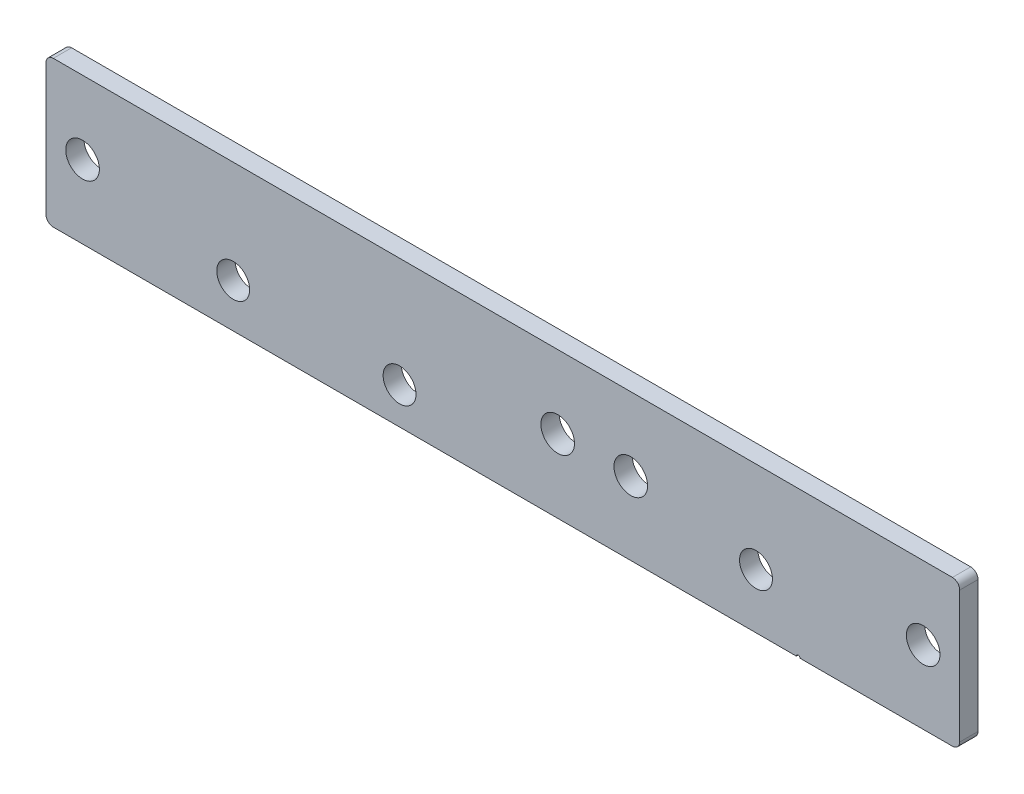
ISO-10303-21;
HEADER;
FILE_DESCRIPTION(('STEP AP214'),'2;1');
FILE_NAME('part.step','',(''),(''),'','','');
FILE_SCHEMA(('AUTOMOTIVE_DESIGN { 1 0 10303 214 1 1 1 1 }'));
ENDSEC;
DATA;
#1=APPLICATION_CONTEXT('core data for automotive mechanical design processes');
#2=APPLICATION_PROTOCOL_DEFINITION('international standard','automotive_design',2000,#1);
#3=PRODUCT_CONTEXT('',#1,'mechanical');
#4=PRODUCT('Part','Part','',(#3));
#5=PRODUCT_RELATED_PRODUCT_CATEGORY('part','',(#4));
#6=PRODUCT_DEFINITION_FORMATION('','',#4);
#7=PRODUCT_DEFINITION_CONTEXT('part definition',#1,'design');
#8=PRODUCT_DEFINITION('design','',#6,#7);
#9=PRODUCT_DEFINITION_SHAPE('','',#8);
#10=(LENGTH_UNIT() NAMED_UNIT(*) SI_UNIT(.MILLI.,.METRE.));
#11=(NAMED_UNIT(*) PLANE_ANGLE_UNIT() SI_UNIT($,.RADIAN.));
#12=(NAMED_UNIT(*) SI_UNIT($,.STERADIAN.) SOLID_ANGLE_UNIT());
#13=UNCERTAINTY_MEASURE_WITH_UNIT(LENGTH_MEASURE(1.E-05),#10,'distance_accuracy_value','');
#14=(GEOMETRIC_REPRESENTATION_CONTEXT(3) GLOBAL_UNCERTAINTY_ASSIGNED_CONTEXT((#13)) GLOBAL_UNIT_ASSIGNED_CONTEXT((#10,
#11,#12)) REPRESENTATION_CONTEXT('',''));
#15=CARTESIAN_POINT('',(0.,0.,0.));
#16=DIRECTION('',(0.,0.,1.));
#17=DIRECTION('',(1.,0.,0.));
#18=AXIS2_PLACEMENT_3D('',#15,#16,#17);
#19=CARTESIAN_POINT('',(-125.,-20.,5.));
#20=DIRECTION('',(0.,1.,0.));
#21=DIRECTION('',(-1.,0.,0.));
#22=AXIS2_PLACEMENT_3D('',#19,#20,#21);
#23=PLANE('',#22);
#24=DIRECTION('',(1.,0.,0.));
#25=VECTOR('',#24,1.);
#26=CARTESIAN_POINT('',(-125.,-20.,5.));
#27=LINE('',#26,#25);
#28=CARTESIAN_POINT('',(81.3290376865502,-20.,5.));
#29=VERTEX_POINT('',#28);
#30=CARTESIAN_POINT('',(123.,-19.9999999999999,5.));
#31=VERTEX_POINT('',#30);
#32=EDGE_CURVE('E118',#29,#31,#27,.T.);
#33=ORIENTED_EDGE('',*,*,#32,.F.);
#34=DIRECTION('',(0.,0.,-1.));
#35=VECTOR('',#34,1.);
#36=CARTESIAN_POINT('',(81.3290376865502,-20.,5.));
#37=LINE('',#36,#35);
#38=CARTESIAN_POINT('',(81.3290376865502,-20.,0.));
#39=VERTEX_POINT('',#38);
#40=EDGE_CURVE('E96',#29,#39,#37,.T.);
#41=ORIENTED_EDGE('',*,*,#40,.T.);
#42=DIRECTION('',(1.,0.,0.));
#43=VECTOR('',#42,1.);
#44=CARTESIAN_POINT('',(-125.,-20.,0.));
#45=LINE('',#44,#43);
#46=CARTESIAN_POINT('',(123.,-19.9999999999999,0.));
#47=VERTEX_POINT('',#46);
#48=EDGE_CURVE('E132',#39,#47,#45,.T.);
#49=ORIENTED_EDGE('',*,*,#48,.T.);
#50=DIRECTION('',(0.,0.,-1.));
#51=VECTOR('',#50,1.);
#52=CARTESIAN_POINT('',(123.,-19.9999999999999,5.));
#53=LINE('',#52,#51);
#54=EDGE_CURVE('E128',#47,#31,#53,.F.);
#55=ORIENTED_EDGE('',*,*,#54,.T.);
#56=EDGE_LOOP('',(#33,#41,#49,#55));
#57=FACE_BOUND('',#56,.T.);
#58=ADVANCED_FACE('F16',(#57),#23,.F.);
#59=CARTESIAN_POINT('',(-125.,20.,5.));
#60=DIRECTION('',(1.,0.,0.));
#61=DIRECTION('',(0.,1.,0.));
#62=AXIS2_PLACEMENT_3D('',#59,#60,#61);
#63=PLANE('',#62);
#64=DIRECTION('',(0.,-1.,0.));
#65=VECTOR('',#64,1.);
#66=CARTESIAN_POINT('',(-125.,20.,0.));
#67=LINE('',#66,#65);
#68=CARTESIAN_POINT('',(-125.,18.,0.));
#69=VERTEX_POINT('',#68);
#70=CARTESIAN_POINT('',(-125.,-18.,0.));
#71=VERTEX_POINT('',#70);
#72=EDGE_CURVE('E129',#69,#71,#67,.T.);
#73=ORIENTED_EDGE('',*,*,#72,.T.);
#74=DIRECTION('',(0.,0.,-1.));
#75=VECTOR('',#74,1.);
#76=CARTESIAN_POINT('',(-125.,-18.,5.));
#77=LINE('',#76,#75);
#78=CARTESIAN_POINT('',(-125.,-18.,5.));
#79=VERTEX_POINT('',#78);
#80=EDGE_CURVE('E156',#71,#79,#77,.F.);
#81=ORIENTED_EDGE('',*,*,#80,.T.);
#82=DIRECTION('',(0.,-1.,0.));
#83=VECTOR('',#82,1.);
#84=CARTESIAN_POINT('',(-125.,20.,5.));
#85=LINE('',#84,#83);
#86=CARTESIAN_POINT('',(-125.,18.,5.));
#87=VERTEX_POINT('',#86);
#88=EDGE_CURVE('E123',#87,#79,#85,.T.);
#89=ORIENTED_EDGE('',*,*,#88,.F.);
#90=DIRECTION('',(0.,0.,-1.));
#91=VECTOR('',#90,1.);
#92=CARTESIAN_POINT('',(-125.,18.,5.));
#93=LINE('',#92,#91);
#94=EDGE_CURVE('E153',#87,#69,#93,.T.);
#95=ORIENTED_EDGE('',*,*,#94,.T.);
#96=EDGE_LOOP('',(#73,#81,#89,#95));
#97=FACE_BOUND('',#96,.T.);
#98=ADVANCED_FACE('F190',(#97),#63,.F.);
#99=CARTESIAN_POINT('',(-123.,-20.,0.));
#100=VERTEX_POINT('',#99);
#101=CARTESIAN_POINT('',(80.3290376865502,-20.,0.));
#102=VERTEX_POINT('',#101);
#103=EDGE_CURVE('E110',#100,#102,#45,.T.);
#104=ORIENTED_EDGE('',*,*,#103,.T.);
#105=DIRECTION('',(0.,0.,-1.));
#106=VECTOR('',#105,1.);
#107=CARTESIAN_POINT('',(80.3290376865502,-20.,5.));
#108=LINE('',#107,#106);
#109=CARTESIAN_POINT('',(80.3290376865502,-20.,5.));
#110=VERTEX_POINT('',#109);
#111=EDGE_CURVE('E31',#102,#110,#108,.F.);
#112=ORIENTED_EDGE('',*,*,#111,.T.);
#113=CARTESIAN_POINT('',(-123.,-20.,5.));
#114=VERTEX_POINT('',#113);
#115=EDGE_CURVE('E107',#114,#110,#27,.T.);
#116=ORIENTED_EDGE('',*,*,#115,.F.);
#117=DIRECTION('',(0.,0.,-1.));
#118=VECTOR('',#117,1.);
#119=CARTESIAN_POINT('',(-123.,-20.,5.));
#120=LINE('',#119,#118);
#121=EDGE_CURVE('E142',#114,#100,#120,.T.);
#122=ORIENTED_EDGE('',*,*,#121,.T.);
#123=EDGE_LOOP('',(#104,#112,#116,#122));
#124=FACE_BOUND('',#123,.T.);
#125=ADVANCED_FACE('F105',(#124),#23,.F.);
#126=CARTESIAN_POINT('',(125.,20.,5.));
#127=DIRECTION('',(-1.,0.,0.));
#128=DIRECTION('',(0.,0.,1.));
#129=AXIS2_PLACEMENT_3D('',#126,#127,#128);
#130=PLANE('',#129);
#131=DIRECTION('',(0.,1.,0.));
#132=VECTOR('',#131,1.);
#133=CARTESIAN_POINT('',(125.,20.,5.));
#134=LINE('',#133,#132);
#135=CARTESIAN_POINT('',(125.,-17.9999999999999,5.));
#136=VERTEX_POINT('',#135);
#137=CARTESIAN_POINT('',(125.,18.,5.));
#138=VERTEX_POINT('',#137);
#139=EDGE_CURVE('E117',#136,#138,#134,.T.);
#140=ORIENTED_EDGE('',*,*,#139,.F.);
#141=DIRECTION('',(0.,0.,-1.));
#142=VECTOR('',#141,1.);
#143=CARTESIAN_POINT('',(125.,-17.9999999999999,5.));
#144=LINE('',#143,#142);
#145=CARTESIAN_POINT('',(125.,-17.9999999999999,0.));
#146=VERTEX_POINT('',#145);
#147=EDGE_CURVE('E10',#136,#146,#144,.T.);
#148=ORIENTED_EDGE('',*,*,#147,.T.);
#149=DIRECTION('',(0.,1.,0.));
#150=VECTOR('',#149,1.);
#151=CARTESIAN_POINT('',(125.,20.,0.));
#152=LINE('',#151,#150);
#153=CARTESIAN_POINT('',(125.,18.,0.));
#154=VERTEX_POINT('',#153);
#155=EDGE_CURVE('E135',#146,#154,#152,.T.);
#156=ORIENTED_EDGE('',*,*,#155,.T.);
#157=DIRECTION('',(0.,0.,-1.));
#158=VECTOR('',#157,1.);
#159=CARTESIAN_POINT('',(125.,18.,5.));
#160=LINE('',#159,#158);
#161=EDGE_CURVE('E24',#154,#138,#160,.F.);
#162=ORIENTED_EDGE('',*,*,#161,.T.);
#163=EDGE_LOOP('',(#140,#148,#156,#162));
#164=FACE_BOUND('',#163,.T.);
#165=ADVANCED_FACE('F171',(#164),#130,.F.);
#166=CARTESIAN_POINT('',(-125.,20.,5.));
#167=DIRECTION('',(0.,-1.,0.));
#168=DIRECTION('',(0.,0.,-1.));
#169=AXIS2_PLACEMENT_3D('',#166,#167,#168);
#170=PLANE('',#169);
#171=DIRECTION('',(-1.,0.,0.));
#172=VECTOR('',#171,1.);
#173=CARTESIAN_POINT('',(-125.,20.,0.));
#174=LINE('',#173,#172);
#175=CARTESIAN_POINT('',(123.,20.,0.));
#176=VERTEX_POINT('',#175);
#177=CARTESIAN_POINT('',(-123.,20.,0.));
#178=VERTEX_POINT('',#177);
#179=EDGE_CURVE('E138',#176,#178,#174,.T.);
#180=ORIENTED_EDGE('',*,*,#179,.T.);
#181=DIRECTION('',(0.,0.,-1.));
#182=VECTOR('',#181,1.);
#183=CARTESIAN_POINT('',(-123.,20.,5.));
#184=LINE('',#183,#182);
#185=CARTESIAN_POINT('',(-123.,20.,5.));
#186=VERTEX_POINT('',#185);
#187=EDGE_CURVE('E39',#178,#186,#184,.F.);
#188=ORIENTED_EDGE('',*,*,#187,.T.);
#189=DIRECTION('',(-1.,0.,0.));
#190=VECTOR('',#189,1.);
#191=CARTESIAN_POINT('',(-125.,20.,5.));
#192=LINE('',#191,#190);
#193=CARTESIAN_POINT('',(123.,20.,5.));
#194=VERTEX_POINT('',#193);
#195=EDGE_CURVE('E121',#194,#186,#192,.T.);
#196=ORIENTED_EDGE('',*,*,#195,.F.);
#197=DIRECTION('',(0.,0.,-1.));
#198=VECTOR('',#197,1.);
#199=CARTESIAN_POINT('',(123.,20.,5.));
#200=LINE('',#199,#198);
#201=EDGE_CURVE('E165',#194,#176,#200,.T.);
#202=ORIENTED_EDGE('',*,*,#201,.T.);
#203=EDGE_LOOP('',(#180,#188,#196,#202));
#204=FACE_BOUND('',#203,.T.);
#205=ADVANCED_FACE('F179',(#204),#170,.F.);
#206=CARTESIAN_POINT('',(0.,0.,5.));
#207=DIRECTION('',(0.,0.,1.));
#208=DIRECTION('',(1.,0.,0.));
#209=AXIS2_PLACEMENT_3D('',#206,#207,#208);
#210=PLANE('',#209);
#211=CARTESIAN_POINT('',(80.8290376865502,-20.,5.));
#212=DIRECTION('',(0.,0.,-1.));
#213=DIRECTION('',(-1.,0.,0.));
#214=AXIS2_PLACEMENT_3D('',#211,#212,#213);
#215=CIRCLE('',#214,0.499999999999999);
#216=EDGE_CURVE('E93',#110,#29,#215,.T.);
#217=ORIENTED_EDGE('',*,*,#216,.T.);
#218=ORIENTED_EDGE('',*,*,#32,.T.);
#219=CARTESIAN_POINT('',(123.,-17.9999999999999,5.));
#220=DIRECTION('',(0.,0.,1.));
#221=DIRECTION('',(1.,0.,0.));
#222=AXIS2_PLACEMENT_3D('',#219,#220,#221);
#223=CIRCLE('',#222,2.);
#224=EDGE_CURVE('E160',#31,#136,#223,.T.);
#225=ORIENTED_EDGE('',*,*,#224,.T.);
#226=ORIENTED_EDGE('',*,*,#139,.T.);
#227=CARTESIAN_POINT('',(123.,18.,5.));
#228=DIRECTION('',(0.,0.,1.));
#229=DIRECTION('',(1.,0.,0.));
#230=AXIS2_PLACEMENT_3D('',#227,#228,#229);
#231=CIRCLE('',#230,2.);
#232=EDGE_CURVE('E158',#138,#194,#231,.T.);
#233=ORIENTED_EDGE('',*,*,#232,.T.);
#234=ORIENTED_EDGE('',*,*,#195,.T.);
#235=CARTESIAN_POINT('',(-123.,18.,5.));
#236=DIRECTION('',(0.,0.,1.));
#237=DIRECTION('',(1.,0.,0.));
#238=AXIS2_PLACEMENT_3D('',#235,#236,#237);
#239=CIRCLE('',#238,2.);
#240=EDGE_CURVE('E162',#186,#87,#239,.T.);
#241=ORIENTED_EDGE('',*,*,#240,.T.);
#242=ORIENTED_EDGE('',*,*,#88,.T.);
#243=CARTESIAN_POINT('',(-123.,-18.,5.));
#244=DIRECTION('',(0.,0.,1.));
#245=DIRECTION('',(1.,0.,0.));
#246=AXIS2_PLACEMENT_3D('',#243,#244,#245);
#247=CIRCLE('',#246,2.);
#248=EDGE_CURVE('E116',#79,#114,#247,.T.);
#249=ORIENTED_EDGE('',*,*,#248,.T.);
#250=ORIENTED_EDGE('',*,*,#115,.T.);
#251=EDGE_LOOP('',(#217,#218,#225,#226,#233,#234,#241,#242,#249,#250));
#252=FACE_BOUND('',#251,.T.);
#253=CARTESIAN_POINT('',(15.,0.,5.));
#254=DIRECTION('',(0.,0.,1.));
#255=DIRECTION('',(1.,0.,0.));
#256=AXIS2_PLACEMENT_3D('',#253,#254,#255);
#257=CIRCLE('',#256,4.6);
#258=CARTESIAN_POINT('',(19.6,0.,5.));
#259=VERTEX_POINT('',#258);
#260=EDGE_CURVE('E198',#259,#259,#257,.T.);
#261=ORIENTED_EDGE('',*,*,#260,.F.);
#262=EDGE_LOOP('',(#261));
#263=FACE_BOUND('',#262,.T.);
#264=CARTESIAN_POINT('',(35.,0.,5.));
#265=DIRECTION('',(0.,0.,1.));
#266=DIRECTION('',(1.,0.,0.));
#267=AXIS2_PLACEMENT_3D('',#264,#265,#266);
#268=CIRCLE('',#267,4.6);
#269=CARTESIAN_POINT('',(39.6,0.,5.));
#270=VERTEX_POINT('',#269);
#271=EDGE_CURVE('E206',#270,#270,#268,.T.);
#272=ORIENTED_EDGE('',*,*,#271,.F.);
#273=EDGE_LOOP('',(#272));
#274=FACE_BOUND('',#273,.T.);
#275=CARTESIAN_POINT('',(115.,0.,5.));
#276=DIRECTION('',(0.,0.,1.));
#277=DIRECTION('',(1.,0.,0.));
#278=AXIS2_PLACEMENT_3D('',#275,#276,#277);
#279=CIRCLE('',#278,4.60000000000001);
#280=CARTESIAN_POINT('',(119.6,0.,5.));
#281=VERTEX_POINT('',#280);
#282=EDGE_CURVE('E197',#281,#281,#279,.T.);
#283=ORIENTED_EDGE('',*,*,#282,.F.);
#284=EDGE_LOOP('',(#283));
#285=FACE_BOUND('',#284,.T.);
#286=CARTESIAN_POINT('',(-115.,0.,5.));
#287=DIRECTION('',(0.,0.,1.));
#288=DIRECTION('',(1.,0.,0.));
#289=AXIS2_PLACEMENT_3D('',#286,#287,#288);
#290=CIRCLE('',#289,4.6);
#291=CARTESIAN_POINT('',(-110.4,0.,5.));
#292=VERTEX_POINT('',#291);
#293=EDGE_CURVE('E205',#292,#292,#290,.T.);
#294=ORIENTED_EDGE('',*,*,#293,.F.);
#295=EDGE_LOOP('',(#294));
#296=FACE_BOUND('',#295,.T.);
#297=CARTESIAN_POINT('',(-28.2604944192385,-10.,5.));
#298=DIRECTION('',(0.,0.,1.));
#299=DIRECTION('',(1.,0.,0.));
#300=AXIS2_PLACEMENT_3D('',#297,#298,#299);
#301=CIRCLE('',#300,4.5);
#302=CARTESIAN_POINT('',(-23.7604944192385,-10.,5.));
#303=VERTEX_POINT('',#302);
#304=EDGE_CURVE('E222',#303,#303,#301,.T.);
#305=ORIENTED_EDGE('',*,*,#304,.F.);
#306=EDGE_LOOP('',(#305));
#307=FACE_BOUND('',#306,.T.);
#308=CARTESIAN_POINT('',(69.2576396401435,-5.00000000000002,5.));
#309=DIRECTION('',(0.,0.,1.));
#310=DIRECTION('',(1.,0.,0.));
#311=AXIS2_PLACEMENT_3D('',#308,#309,#310);
#312=CIRCLE('',#311,4.5);
#313=CARTESIAN_POINT('',(73.7576396401435,-5.00000000000002,5.));
#314=VERTEX_POINT('',#313);
#315=EDGE_CURVE('E221',#314,#314,#312,.T.);
#316=ORIENTED_EDGE('',*,*,#315,.F.);
#317=EDGE_LOOP('',(#316));
#318=FACE_BOUND('',#317,.T.);
#319=CARTESIAN_POINT('',(-73.7805026402359,-8.00000000000002,5.));
#320=DIRECTION('',(0.,0.,1.));
#321=DIRECTION('',(1.,0.,0.));
#322=AXIS2_PLACEMENT_3D('',#319,#320,#321);
#323=CIRCLE('',#322,4.49999999990899);
#324=CARTESIAN_POINT('',(-69.2805026403269,-8.00000000000002,5.));
#325=VERTEX_POINT('',#324);
#326=EDGE_CURVE('E229',#325,#325,#323,.T.);
#327=ORIENTED_EDGE('',*,*,#326,.F.);
#328=EDGE_LOOP('',(#327));
#329=FACE_BOUND('',#328,.T.);
#330=ADVANCED_FACE('F112',(#252,#263,#274,#285,#296,#307,#318,#329),#210,.T.);
#331=CARTESIAN_POINT('',(0.,0.,0.));
#332=DIRECTION('',(0.,0.,1.));
#333=DIRECTION('',(1.,0.,0.));
#334=AXIS2_PLACEMENT_3D('',#331,#332,#333);
#335=PLANE('',#334);
#336=CARTESIAN_POINT('',(15.,0.,0.));
#337=DIRECTION('',(0.,0.,1.));
#338=DIRECTION('',(1.,0.,0.));
#339=AXIS2_PLACEMENT_3D('',#336,#337,#338);
#340=CIRCLE('',#339,4.6);
#341=CARTESIAN_POINT('',(19.6,0.,0.));
#342=VERTEX_POINT('',#341);
#343=EDGE_CURVE('E201',#342,#342,#340,.F.);
#344=ORIENTED_EDGE('',*,*,#343,.F.);
#345=EDGE_LOOP('',(#344));
#346=FACE_BOUND('',#345,.T.);
#347=CARTESIAN_POINT('',(35.,0.,0.));
#348=DIRECTION('',(0.,0.,1.));
#349=DIRECTION('',(1.,0.,0.));
#350=AXIS2_PLACEMENT_3D('',#347,#348,#349);
#351=CIRCLE('',#350,4.6);
#352=CARTESIAN_POINT('',(39.6,0.,0.));
#353=VERTEX_POINT('',#352);
#354=EDGE_CURVE('E202',#353,#353,#351,.F.);
#355=ORIENTED_EDGE('',*,*,#354,.F.);
#356=EDGE_LOOP('',(#355));
#357=FACE_BOUND('',#356,.T.);
#358=CARTESIAN_POINT('',(115.,0.,0.));
#359=DIRECTION('',(0.,0.,1.));
#360=DIRECTION('',(1.,0.,0.));
#361=AXIS2_PLACEMENT_3D('',#358,#359,#360);
#362=CIRCLE('',#361,4.60000000000001);
#363=CARTESIAN_POINT('',(119.6,0.,0.));
#364=VERTEX_POINT('',#363);
#365=EDGE_CURVE('E209',#364,#364,#362,.F.);
#366=ORIENTED_EDGE('',*,*,#365,.F.);
#367=EDGE_LOOP('',(#366));
#368=FACE_BOUND('',#367,.T.);
#369=CARTESIAN_POINT('',(-115.,0.,0.));
#370=DIRECTION('',(0.,0.,1.));
#371=DIRECTION('',(1.,0.,0.));
#372=AXIS2_PLACEMENT_3D('',#369,#370,#371);
#373=CIRCLE('',#372,4.6);
#374=CARTESIAN_POINT('',(-110.4,0.,0.));
#375=VERTEX_POINT('',#374);
#376=EDGE_CURVE('E218',#375,#375,#373,.F.);
#377=ORIENTED_EDGE('',*,*,#376,.F.);
#378=EDGE_LOOP('',(#377));
#379=FACE_BOUND('',#378,.T.);
#380=CARTESIAN_POINT('',(-28.2604944192385,-10.,0.));
#381=DIRECTION('',(0.,0.,1.));
#382=DIRECTION('',(1.,0.,0.));
#383=AXIS2_PLACEMENT_3D('',#380,#381,#382);
#384=CIRCLE('',#383,4.5);
#385=CARTESIAN_POINT('',(-23.7604944192385,-10.,0.));
#386=VERTEX_POINT('',#385);
#387=EDGE_CURVE('E225',#386,#386,#384,.F.);
#388=ORIENTED_EDGE('',*,*,#387,.F.);
#389=EDGE_LOOP('',(#388));
#390=FACE_BOUND('',#389,.T.);
#391=CARTESIAN_POINT('',(69.2576396401435,-5.00000000000002,0.));
#392=DIRECTION('',(0.,0.,1.));
#393=DIRECTION('',(1.,0.,0.));
#394=AXIS2_PLACEMENT_3D('',#391,#392,#393);
#395=CIRCLE('',#394,4.5);
#396=CARTESIAN_POINT('',(73.7576396401435,-5.00000000000002,0.));
#397=VERTEX_POINT('',#396);
#398=EDGE_CURVE('E226',#397,#397,#395,.F.);
#399=ORIENTED_EDGE('',*,*,#398,.F.);
#400=EDGE_LOOP('',(#399));
#401=FACE_BOUND('',#400,.T.);
#402=CARTESIAN_POINT('',(-73.7805026402359,-8.00000000000002,0.));
#403=DIRECTION('',(0.,0.,1.));
#404=DIRECTION('',(1.,0.,0.));
#405=AXIS2_PLACEMENT_3D('',#402,#403,#404);
#406=CIRCLE('',#405,4.49999999990899);
#407=CARTESIAN_POINT('',(-69.2805026403269,-8.00000000000002,0.));
#408=VERTEX_POINT('',#407);
#409=EDGE_CURVE('E133',#408,#408,#406,.F.);
#410=ORIENTED_EDGE('',*,*,#409,.F.);
#411=EDGE_LOOP('',(#410));
#412=FACE_BOUND('',#411,.T.);
#413=ORIENTED_EDGE('',*,*,#48,.F.);
#414=CARTESIAN_POINT('',(80.8290376865502,-20.,0.));
#415=DIRECTION('',(0.,0.,-1.));
#416=DIRECTION('',(-1.,0.,0.));
#417=AXIS2_PLACEMENT_3D('',#414,#415,#416);
#418=CIRCLE('',#417,0.499999999999999);
#419=EDGE_CURVE('E100',#102,#39,#418,.T.);
#420=ORIENTED_EDGE('',*,*,#419,.F.);
#421=ORIENTED_EDGE('',*,*,#103,.F.);
#422=CARTESIAN_POINT('',(-123.,-18.,0.));
#423=DIRECTION('',(0.,0.,1.));
#424=DIRECTION('',(1.,0.,0.));
#425=AXIS2_PLACEMENT_3D('',#422,#423,#424);
#426=CIRCLE('',#425,2.);
#427=EDGE_CURVE('E151',#100,#71,#426,.F.);
#428=ORIENTED_EDGE('',*,*,#427,.T.);
#429=ORIENTED_EDGE('',*,*,#72,.F.);
#430=CARTESIAN_POINT('',(-123.,18.,0.));
#431=DIRECTION('',(0.,0.,1.));
#432=DIRECTION('',(1.,0.,0.));
#433=AXIS2_PLACEMENT_3D('',#430,#431,#432);
#434=CIRCLE('',#433,2.);
#435=EDGE_CURVE('E149',#69,#178,#434,.F.);
#436=ORIENTED_EDGE('',*,*,#435,.T.);
#437=ORIENTED_EDGE('',*,*,#179,.F.);
#438=CARTESIAN_POINT('',(123.,18.,0.));
#439=DIRECTION('',(0.,0.,1.));
#440=DIRECTION('',(1.,0.,0.));
#441=AXIS2_PLACEMENT_3D('',#438,#439,#440);
#442=CIRCLE('',#441,2.);
#443=EDGE_CURVE('E144',#176,#154,#442,.F.);
#444=ORIENTED_EDGE('',*,*,#443,.T.);
#445=ORIENTED_EDGE('',*,*,#155,.F.);
#446=CARTESIAN_POINT('',(123.,-17.9999999999999,0.));
#447=DIRECTION('',(0.,0.,1.));
#448=DIRECTION('',(1.,0.,0.));
#449=AXIS2_PLACEMENT_3D('',#446,#447,#448);
#450=CIRCLE('',#449,2.);
#451=EDGE_CURVE('E146',#146,#47,#450,.F.);
#452=ORIENTED_EDGE('',*,*,#451,.T.);
#453=EDGE_LOOP('',(#413,#420,#421,#428,#429,#436,#437,#444,#445,#452));
#454=FACE_BOUND('',#453,.T.);
#455=ADVANCED_FACE('F182',(#346,#357,#368,#379,#390,#401,#412,#454),#335,.F.);
#456=CARTESIAN_POINT('',(-73.7805026402359,-8.00000000000002,-12.7279220613579));
#457=DIRECTION('',(0.,0.,1.));
#458=DIRECTION('',(1.,0.,0.));
#459=AXIS2_PLACEMENT_3D('',#456,#457,#458);
#460=CYLINDRICAL_SURFACE('',#459,4.49999999990899);
#461=ORIENTED_EDGE('',*,*,#409,.T.);
#462=EDGE_LOOP('',(#461));
#463=FACE_BOUND('',#462,.T.);
#464=ORIENTED_EDGE('',*,*,#326,.T.);
#465=EDGE_LOOP('',(#464));
#466=FACE_BOUND('',#465,.T.);
#467=ADVANCED_FACE('F238',(#463,#466),#460,.F.);
#468=CARTESIAN_POINT('',(69.2576396401435,-5.00000000000002,-12.7279220613579));
#469=DIRECTION('',(0.,0.,1.));
#470=DIRECTION('',(1.,0.,0.));
#471=AXIS2_PLACEMENT_3D('',#468,#469,#470);
#472=CYLINDRICAL_SURFACE('',#471,4.5);
#473=ORIENTED_EDGE('',*,*,#398,.T.);
#474=EDGE_LOOP('',(#473));
#475=FACE_BOUND('',#474,.T.);
#476=ORIENTED_EDGE('',*,*,#315,.T.);
#477=EDGE_LOOP('',(#476));
#478=FACE_BOUND('',#477,.T.);
#479=ADVANCED_FACE('F249',(#475,#478),#472,.F.);
#480=CARTESIAN_POINT('',(-28.2604944192385,-10.,-12.7279220613579));
#481=DIRECTION('',(0.,0.,1.));
#482=DIRECTION('',(1.,0.,0.));
#483=AXIS2_PLACEMENT_3D('',#480,#481,#482);
#484=CYLINDRICAL_SURFACE('',#483,4.5);
#485=ORIENTED_EDGE('',*,*,#387,.T.);
#486=EDGE_LOOP('',(#485));
#487=FACE_BOUND('',#486,.T.);
#488=ORIENTED_EDGE('',*,*,#304,.T.);
#489=EDGE_LOOP('',(#488));
#490=FACE_BOUND('',#489,.T.);
#491=ADVANCED_FACE('F303',(#487,#490),#484,.F.);
#492=CARTESIAN_POINT('',(-123.,-18.,5.));
#493=DIRECTION('',(0.,0.,-1.));
#494=DIRECTION('',(-1.,0.,0.));
#495=AXIS2_PLACEMENT_3D('',#492,#493,#494);
#496=CYLINDRICAL_SURFACE('',#495,2.);
#497=ORIENTED_EDGE('',*,*,#248,.F.);
#498=ORIENTED_EDGE('',*,*,#80,.F.);
#499=ORIENTED_EDGE('',*,*,#427,.F.);
#500=ORIENTED_EDGE('',*,*,#121,.F.);
#501=EDGE_LOOP('',(#497,#498,#499,#500));
#502=FACE_BOUND('',#501,.T.);
#503=ADVANCED_FACE('F193',(#502),#496,.T.);
#504=CARTESIAN_POINT('',(-123.,18.,5.));
#505=DIRECTION('',(0.,0.,-1.));
#506=DIRECTION('',(-1.,0.,0.));
#507=AXIS2_PLACEMENT_3D('',#504,#505,#506);
#508=CYLINDRICAL_SURFACE('',#507,2.);
#509=ORIENTED_EDGE('',*,*,#240,.F.);
#510=ORIENTED_EDGE('',*,*,#187,.F.);
#511=ORIENTED_EDGE('',*,*,#435,.F.);
#512=ORIENTED_EDGE('',*,*,#94,.F.);
#513=EDGE_LOOP('',(#509,#510,#511,#512));
#514=FACE_BOUND('',#513,.T.);
#515=ADVANCED_FACE('F187',(#514),#508,.T.);
#516=CARTESIAN_POINT('',(123.,-17.9999999999999,5.));
#517=DIRECTION('',(0.,0.,-1.));
#518=DIRECTION('',(-1.,0.,0.));
#519=AXIS2_PLACEMENT_3D('',#516,#517,#518);
#520=CYLINDRICAL_SURFACE('',#519,2.);
#521=ORIENTED_EDGE('',*,*,#224,.F.);
#522=ORIENTED_EDGE('',*,*,#54,.F.);
#523=ORIENTED_EDGE('',*,*,#451,.F.);
#524=ORIENTED_EDGE('',*,*,#147,.F.);
#525=EDGE_LOOP('',(#521,#522,#523,#524));
#526=FACE_BOUND('',#525,.T.);
#527=ADVANCED_FACE('F331',(#526),#520,.T.);
#528=CARTESIAN_POINT('',(123.,18.,5.));
#529=DIRECTION('',(0.,0.,-1.));
#530=DIRECTION('',(-1.,0.,0.));
#531=AXIS2_PLACEMENT_3D('',#528,#529,#530);
#532=CYLINDRICAL_SURFACE('',#531,2.);
#533=ORIENTED_EDGE('',*,*,#232,.F.);
#534=ORIENTED_EDGE('',*,*,#161,.F.);
#535=ORIENTED_EDGE('',*,*,#443,.F.);
#536=ORIENTED_EDGE('',*,*,#201,.F.);
#537=EDGE_LOOP('',(#533,#534,#535,#536));
#538=FACE_BOUND('',#537,.T.);
#539=ADVANCED_FACE('F18',(#538),#532,.T.);
#540=CARTESIAN_POINT('',(-115.,0.,-13.0107647738325));
#541=DIRECTION('',(0.,0.,1.));
#542=DIRECTION('',(1.,0.,0.));
#543=AXIS2_PLACEMENT_3D('',#540,#541,#542);
#544=CYLINDRICAL_SURFACE('',#543,4.6);
#545=ORIENTED_EDGE('',*,*,#376,.T.);
#546=EDGE_LOOP('',(#545));
#547=FACE_BOUND('',#546,.T.);
#548=ORIENTED_EDGE('',*,*,#293,.T.);
#549=EDGE_LOOP('',(#548));
#550=FACE_BOUND('',#549,.T.);
#551=ADVANCED_FACE('F348',(#547,#550),#544,.F.);
#552=CARTESIAN_POINT('',(115.,0.,-13.0107647738325));
#553=DIRECTION('',(0.,0.,1.));
#554=DIRECTION('',(1.,0.,0.));
#555=AXIS2_PLACEMENT_3D('',#552,#553,#554);
#556=CYLINDRICAL_SURFACE('',#555,4.60000000000001);
#557=ORIENTED_EDGE('',*,*,#365,.T.);
#558=EDGE_LOOP('',(#557));
#559=FACE_BOUND('',#558,.T.);
#560=ORIENTED_EDGE('',*,*,#282,.T.);
#561=EDGE_LOOP('',(#560));
#562=FACE_BOUND('',#561,.T.);
#563=ADVANCED_FACE('F356',(#559,#562),#556,.F.);
#564=CARTESIAN_POINT('',(35.,0.,-13.0107647738325));
#565=DIRECTION('',(0.,0.,1.));
#566=DIRECTION('',(1.,0.,0.));
#567=AXIS2_PLACEMENT_3D('',#564,#565,#566);
#568=CYLINDRICAL_SURFACE('',#567,4.6);
#569=ORIENTED_EDGE('',*,*,#354,.T.);
#570=EDGE_LOOP('',(#569));
#571=FACE_BOUND('',#570,.T.);
#572=ORIENTED_EDGE('',*,*,#271,.T.);
#573=EDGE_LOOP('',(#572));
#574=FACE_BOUND('',#573,.T.);
#575=ADVANCED_FACE('F366',(#571,#574),#568,.F.);
#576=CARTESIAN_POINT('',(15.,0.,-13.0107647738325));
#577=DIRECTION('',(0.,0.,1.));
#578=DIRECTION('',(1.,0.,0.));
#579=AXIS2_PLACEMENT_3D('',#576,#577,#578);
#580=CYLINDRICAL_SURFACE('',#579,4.6);
#581=ORIENTED_EDGE('',*,*,#343,.T.);
#582=EDGE_LOOP('',(#581));
#583=FACE_BOUND('',#582,.T.);
#584=ORIENTED_EDGE('',*,*,#260,.T.);
#585=EDGE_LOOP('',(#584));
#586=FACE_BOUND('',#585,.T.);
#587=ADVANCED_FACE('F376',(#583,#586),#580,.F.);
#588=CARTESIAN_POINT('',(80.8290376865502,-20.,5.));
#589=DIRECTION('',(0.,0.,-1.));
#590=DIRECTION('',(-1.,0.,0.));
#591=AXIS2_PLACEMENT_3D('',#588,#589,#590);
#592=CYLINDRICAL_SURFACE('',#591,0.499999999999999);
#593=ORIENTED_EDGE('',*,*,#216,.F.);
#594=ORIENTED_EDGE('',*,*,#111,.F.);
#595=ORIENTED_EDGE('',*,*,#419,.T.);
#596=ORIENTED_EDGE('',*,*,#40,.F.);
#597=EDGE_LOOP('',(#593,#594,#595,#596));
#598=FACE_BOUND('',#597,.T.);
#599=ADVANCED_FACE('F94',(#598),#592,.F.);
#600=CLOSED_SHELL('',(#58,#98,#125,#165,#205,#330,#455,#467,#479,#491,#503,#515,#527,#539,#551,
#563,#575,#587,#599));
#601=MANIFOLD_SOLID_BREP('B1',#600);
#602=ADVANCED_BREP_SHAPE_REPRESENTATION('',(#18,#601),#14);
#603=SHAPE_DEFINITION_REPRESENTATION(#9,#602);
ENDSEC;
END-ISO-10303-21;
